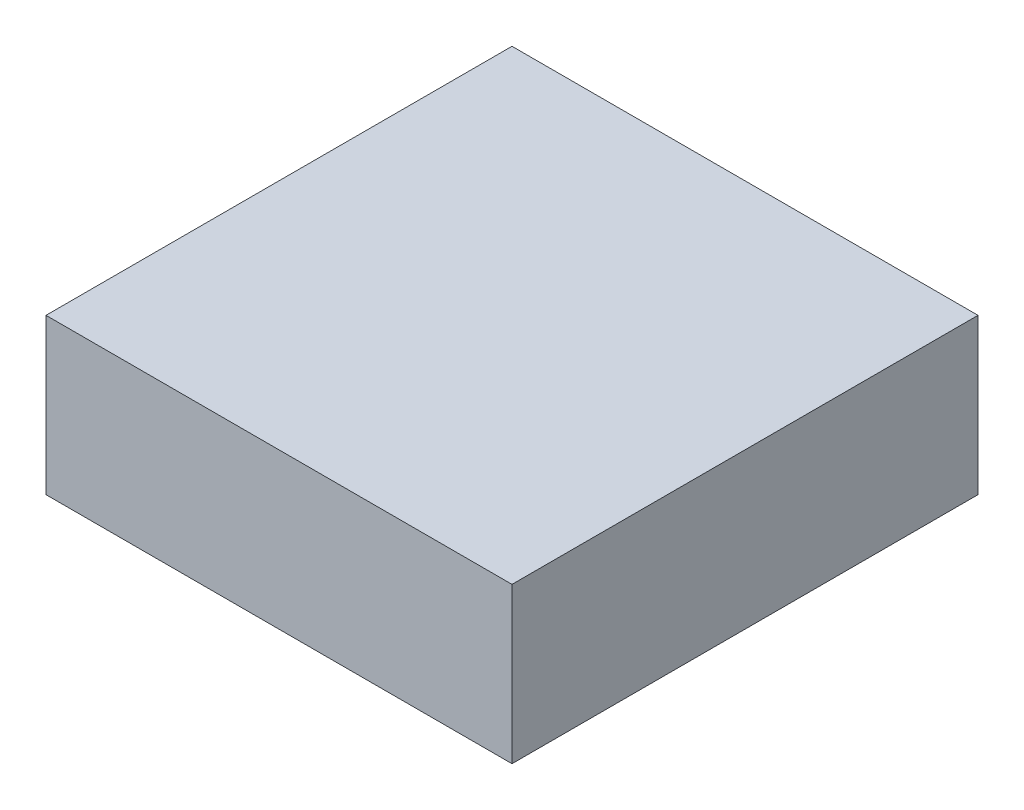
ISO-10303-21;
HEADER;
FILE_DESCRIPTION(('STEP AP214'),'2;1');
FILE_NAME('part.step','',(''),(''),'','','');
FILE_SCHEMA(('AUTOMOTIVE_DESIGN { 1 0 10303 214 1 1 1 1 }'));
ENDSEC;
DATA;
#1=APPLICATION_CONTEXT('core data for automotive mechanical design processes');
#2=APPLICATION_PROTOCOL_DEFINITION('international standard','automotive_design',2000,#1);
#3=PRODUCT_CONTEXT('',#1,'mechanical');
#4=PRODUCT('Part','Part','',(#3));
#5=PRODUCT_RELATED_PRODUCT_CATEGORY('part','',(#4));
#6=PRODUCT_DEFINITION_FORMATION('','',#4);
#7=PRODUCT_DEFINITION_CONTEXT('part definition',#1,'design');
#8=PRODUCT_DEFINITION('design','',#6,#7);
#9=PRODUCT_DEFINITION_SHAPE('','',#8);
#10=(LENGTH_UNIT() NAMED_UNIT(*) SI_UNIT(.MILLI.,.METRE.));
#11=(NAMED_UNIT(*) PLANE_ANGLE_UNIT() SI_UNIT($,.RADIAN.));
#12=(NAMED_UNIT(*) SI_UNIT($,.STERADIAN.) SOLID_ANGLE_UNIT());
#13=UNCERTAINTY_MEASURE_WITH_UNIT(LENGTH_MEASURE(1.E-05),#10,'distance_accuracy_value','');
#14=(GEOMETRIC_REPRESENTATION_CONTEXT(3) GLOBAL_UNCERTAINTY_ASSIGNED_CONTEXT((#13)) GLOBAL_UNIT_ASSIGNED_CONTEXT((#10,
#11,#12)) REPRESENTATION_CONTEXT('',''));
#15=CARTESIAN_POINT('',(0.,0.,0.));
#16=DIRECTION('',(0.,0.,1.));
#17=DIRECTION('',(1.,0.,0.));
#18=AXIS2_PLACEMENT_3D('',#15,#16,#17);
#19=CARTESIAN_POINT('',(-15.,10.,-15.));
#20=DIRECTION('',(1.,0.,0.));
#21=DIRECTION('',(0.,0.,-1.));
#22=AXIS2_PLACEMENT_3D('',#19,#20,#21);
#23=PLANE('',#22);
#24=DIRECTION('',(0.,0.,1.));
#25=VECTOR('',#24,1.);
#26=CARTESIAN_POINT('',(-15.,0.,-15.));
#27=LINE('',#26,#25);
#28=CARTESIAN_POINT('',(-15.,0.,-15.));
#29=VERTEX_POINT('',#28);
#30=CARTESIAN_POINT('',(-15.,0.,15.));
#31=VERTEX_POINT('',#30);
#32=EDGE_CURVE('E95',#29,#31,#27,.T.);
#33=ORIENTED_EDGE('',*,*,#32,.T.);
#34=DIRECTION('',(0.,-1.,0.));
#35=VECTOR('',#34,1.);
#36=CARTESIAN_POINT('',(-15.,10.,15.));
#37=LINE('',#36,#35);
#38=CARTESIAN_POINT('',(-15.,10.,15.));
#39=VERTEX_POINT('',#38);
#40=EDGE_CURVE('E11',#39,#31,#37,.T.);
#41=ORIENTED_EDGE('',*,*,#40,.F.);
#42=DIRECTION('',(0.,0.,1.));
#43=VECTOR('',#42,1.);
#44=CARTESIAN_POINT('',(-15.,10.,-15.));
#45=LINE('',#44,#43);
#46=CARTESIAN_POINT('',(-15.,10.,-15.));
#47=VERTEX_POINT('',#46);
#48=EDGE_CURVE('E83',#47,#39,#45,.T.);
#49=ORIENTED_EDGE('',*,*,#48,.F.);
#50=DIRECTION('',(0.,-1.,0.));
#51=VECTOR('',#50,1.);
#52=CARTESIAN_POINT('',(-15.,10.,-15.));
#53=LINE('',#52,#51);
#54=EDGE_CURVE('E91',#47,#29,#53,.T.);
#55=ORIENTED_EDGE('',*,*,#54,.T.);
#56=EDGE_LOOP('',(#33,#41,#49,#55));
#57=FACE_BOUND('',#56,.T.);
#58=ADVANCED_FACE('F32',(#57),#23,.F.);
#59=CARTESIAN_POINT('',(-15.,10.,15.));
#60=DIRECTION('',(0.,0.,-1.));
#61=DIRECTION('',(-1.,0.,0.));
#62=AXIS2_PLACEMENT_3D('',#59,#60,#61);
#63=PLANE('',#62);
#64=DIRECTION('',(1.,0.,0.));
#65=VECTOR('',#64,1.);
#66=CARTESIAN_POINT('',(-15.,0.,15.));
#67=LINE('',#66,#65);
#68=CARTESIAN_POINT('',(15.,0.,15.));
#69=VERTEX_POINT('',#68);
#70=EDGE_CURVE('E87',#31,#69,#67,.T.);
#71=ORIENTED_EDGE('',*,*,#70,.T.);
#72=DIRECTION('',(0.,-1.,0.));
#73=VECTOR('',#72,1.);
#74=CARTESIAN_POINT('',(15.,10.,15.));
#75=LINE('',#74,#73);
#76=CARTESIAN_POINT('',(15.,10.,15.));
#77=VERTEX_POINT('',#76);
#78=EDGE_CURVE('E40',#77,#69,#75,.T.);
#79=ORIENTED_EDGE('',*,*,#78,.F.);
#80=DIRECTION('',(1.,0.,0.));
#81=VECTOR('',#80,1.);
#82=CARTESIAN_POINT('',(-15.,10.,15.));
#83=LINE('',#82,#81);
#84=EDGE_CURVE('E78',#39,#77,#83,.T.);
#85=ORIENTED_EDGE('',*,*,#84,.F.);
#86=ORIENTED_EDGE('',*,*,#40,.T.);
#87=EDGE_LOOP('',(#71,#79,#85,#86));
#88=FACE_BOUND('',#87,.T.);
#89=ADVANCED_FACE('F86',(#88),#63,.F.);
#90=CARTESIAN_POINT('',(15.,10.,-15.));
#91=DIRECTION('',(-1.,0.,0.));
#92=DIRECTION('',(0.,0.,1.));
#93=AXIS2_PLACEMENT_3D('',#90,#91,#92);
#94=PLANE('',#93);
#95=DIRECTION('',(0.,0.,-1.));
#96=VECTOR('',#95,1.);
#97=CARTESIAN_POINT('',(15.,0.,-15.));
#98=LINE('',#97,#96);
#99=CARTESIAN_POINT('',(15.,0.,-15.));
#100=VERTEX_POINT('',#99);
#101=EDGE_CURVE('E65',#69,#100,#98,.T.);
#102=ORIENTED_EDGE('',*,*,#101,.T.);
#103=DIRECTION('',(0.,-1.,0.));
#104=VECTOR('',#103,1.);
#105=CARTESIAN_POINT('',(15.,10.,-15.));
#106=LINE('',#105,#104);
#107=CARTESIAN_POINT('',(15.,10.,-15.));
#108=VERTEX_POINT('',#107);
#109=EDGE_CURVE('E88',#108,#100,#106,.T.);
#110=ORIENTED_EDGE('',*,*,#109,.F.);
#111=DIRECTION('',(0.,0.,-1.));
#112=VECTOR('',#111,1.);
#113=CARTESIAN_POINT('',(15.,10.,-15.));
#114=LINE('',#113,#112);
#115=EDGE_CURVE('E81',#77,#108,#114,.T.);
#116=ORIENTED_EDGE('',*,*,#115,.F.);
#117=ORIENTED_EDGE('',*,*,#78,.T.);
#118=EDGE_LOOP('',(#102,#110,#116,#117));
#119=FACE_BOUND('',#118,.T.);
#120=ADVANCED_FACE('F89',(#119),#94,.F.);
#121=CARTESIAN_POINT('',(-15.,10.,-15.));
#122=DIRECTION('',(0.,0.,1.));
#123=DIRECTION('',(1.,0.,0.));
#124=AXIS2_PLACEMENT_3D('',#121,#122,#123);
#125=PLANE('',#124);
#126=DIRECTION('',(-1.,0.,0.));
#127=VECTOR('',#126,1.);
#128=CARTESIAN_POINT('',(-15.,0.,-15.));
#129=LINE('',#128,#127);
#130=EDGE_CURVE('E71',#100,#29,#129,.T.);
#131=ORIENTED_EDGE('',*,*,#130,.T.);
#132=ORIENTED_EDGE('',*,*,#54,.F.);
#133=DIRECTION('',(-1.,0.,0.));
#134=VECTOR('',#133,1.);
#135=CARTESIAN_POINT('',(-15.,10.,-15.));
#136=LINE('',#135,#134);
#137=EDGE_CURVE('E48',#108,#47,#136,.T.);
#138=ORIENTED_EDGE('',*,*,#137,.F.);
#139=ORIENTED_EDGE('',*,*,#109,.T.);
#140=EDGE_LOOP('',(#131,#132,#138,#139));
#141=FACE_BOUND('',#140,.T.);
#142=ADVANCED_FACE('F102',(#141),#125,.F.);
#143=CARTESIAN_POINT('',(0.,10.,0.));
#144=DIRECTION('',(0.,1.,0.));
#145=DIRECTION('',(0.,0.,1.));
#146=AXIS2_PLACEMENT_3D('',#143,#144,#145);
#147=PLANE('',#146);
#148=ORIENTED_EDGE('',*,*,#48,.T.);
#149=ORIENTED_EDGE('',*,*,#84,.T.);
#150=ORIENTED_EDGE('',*,*,#115,.T.);
#151=ORIENTED_EDGE('',*,*,#137,.T.);
#152=EDGE_LOOP('',(#148,#149,#150,#151));
#153=FACE_BOUND('',#152,.T.);
#154=ADVANCED_FACE('F79',(#153),#147,.T.);
#155=CARTESIAN_POINT('',(0.,0.,0.));
#156=DIRECTION('',(0.,1.,0.));
#157=DIRECTION('',(0.,0.,1.));
#158=AXIS2_PLACEMENT_3D('',#155,#156,#157);
#159=PLANE('',#158);
#160=ORIENTED_EDGE('',*,*,#32,.F.);
#161=ORIENTED_EDGE('',*,*,#130,.F.);
#162=ORIENTED_EDGE('',*,*,#101,.F.);
#163=ORIENTED_EDGE('',*,*,#70,.F.);
#164=EDGE_LOOP('',(#160,#161,#162,#163));
#165=FACE_BOUND('',#164,.T.);
#166=ADVANCED_FACE('F105',(#165),#159,.F.);
#167=CLOSED_SHELL('',(#58,#89,#120,#142,#154,#166));
#168=MANIFOLD_SOLID_BREP('B2',#167);
#169=ADVANCED_BREP_SHAPE_REPRESENTATION('',(#18,#168),#14);
#170=SHAPE_DEFINITION_REPRESENTATION(#9,#169);
ENDSEC;
END-ISO-10303-21;
